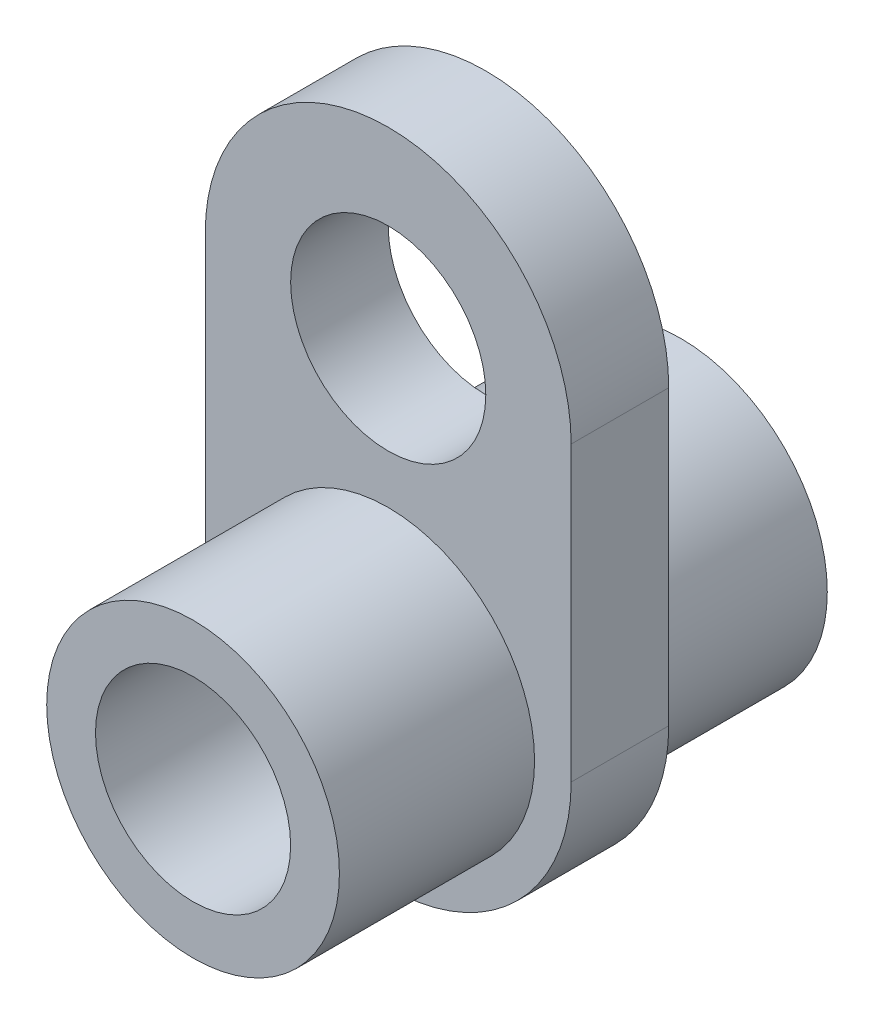
ISO-10303-21;
HEADER;
FILE_DESCRIPTION(('STEP AP214'),'2;1');
FILE_NAME('part.step','',(''),(''),'','','');
FILE_SCHEMA(('AUTOMOTIVE_DESIGN { 1 0 10303 214 1 1 1 1 }'));
ENDSEC;
DATA;
#1=APPLICATION_CONTEXT('core data for automotive mechanical design processes');
#2=APPLICATION_PROTOCOL_DEFINITION('international standard','automotive_design',2000,#1);
#3=PRODUCT_CONTEXT('',#1,'mechanical');
#4=PRODUCT('Part','Part','',(#3));
#5=PRODUCT_RELATED_PRODUCT_CATEGORY('part','',(#4));
#6=PRODUCT_DEFINITION_FORMATION('','',#4);
#7=PRODUCT_DEFINITION_CONTEXT('part definition',#1,'design');
#8=PRODUCT_DEFINITION('design','',#6,#7);
#9=PRODUCT_DEFINITION_SHAPE('','',#8);
#10=(LENGTH_UNIT() NAMED_UNIT(*) SI_UNIT(.MILLI.,.METRE.));
#11=(NAMED_UNIT(*) PLANE_ANGLE_UNIT() SI_UNIT($,.RADIAN.));
#12=(NAMED_UNIT(*) SI_UNIT($,.STERADIAN.) SOLID_ANGLE_UNIT());
#13=UNCERTAINTY_MEASURE_WITH_UNIT(LENGTH_MEASURE(1.E-05),#10,'distance_accuracy_value','');
#14=(GEOMETRIC_REPRESENTATION_CONTEXT(3) GLOBAL_UNCERTAINTY_ASSIGNED_CONTEXT((#13)) GLOBAL_UNIT_ASSIGNED_CONTEXT((#10,
#11,#12)) REPRESENTATION_CONTEXT('',''));
#15=CARTESIAN_POINT('',(0.,0.,0.));
#16=DIRECTION('',(0.,0.,1.));
#17=DIRECTION('',(1.,0.,0.));
#18=AXIS2_PLACEMENT_3D('',#15,#16,#17);
#19=CARTESIAN_POINT('',(-7.50000000000001,0.,-2.));
#20=DIRECTION('',(-1.,0.,0.));
#21=DIRECTION('',(0.,0.,1.));
#22=AXIS2_PLACEMENT_3D('',#19,#20,#21);
#23=PLANE('',#22);
#24=DIRECTION('',(0.,0.,1.));
#25=VECTOR('',#24,1.);
#26=CARTESIAN_POINT('',(-7.50000000000001,-6.,-2.));
#27=LINE('',#26,#25);
#28=CARTESIAN_POINT('',(-7.50000000000001,-6.,-2.));
#29=VERTEX_POINT('',#28);
#30=CARTESIAN_POINT('',(-7.50000000000001,-6.,2.));
#31=VERTEX_POINT('',#30);
#32=EDGE_CURVE('E73',#29,#31,#27,.T.);
#33=ORIENTED_EDGE('',*,*,#32,.T.);
#34=DIRECTION('',(0.,-1.,0.));
#35=VECTOR('',#34,1.);
#36=CARTESIAN_POINT('',(-7.50000000000001,0.,2.));
#37=LINE('',#36,#35);
#38=CARTESIAN_POINT('',(-7.50000000000001,6.,2.));
#39=VERTEX_POINT('',#38);
#40=EDGE_CURVE('E76',#39,#31,#37,.T.);
#41=ORIENTED_EDGE('',*,*,#40,.F.);
#42=DIRECTION('',(0.,0.,1.));
#43=VECTOR('',#42,1.);
#44=CARTESIAN_POINT('',(-7.50000000000001,6.,-2.));
#45=LINE('',#44,#43);
#46=CARTESIAN_POINT('',(-7.50000000000001,6.,-2.));
#47=VERTEX_POINT('',#46);
#48=EDGE_CURVE('E42',#47,#39,#45,.T.);
#49=ORIENTED_EDGE('',*,*,#48,.F.);
#50=DIRECTION('',(0.,-1.,0.));
#51=VECTOR('',#50,1.);
#52=CARTESIAN_POINT('',(-7.50000000000001,0.,-2.));
#53=LINE('',#52,#51);
#54=EDGE_CURVE('E77',#47,#29,#53,.T.);
#55=ORIENTED_EDGE('',*,*,#54,.T.);
#56=EDGE_LOOP('',(#33,#41,#49,#55));
#57=FACE_BOUND('',#56,.T.);
#58=ADVANCED_FACE('F34',(#57),#23,.T.);
#59=CARTESIAN_POINT('',(0.,6.00000000000001,-2.));
#60=DIRECTION('',(0.,0.,1.));
#61=DIRECTION('',(1.,0.,0.));
#62=AXIS2_PLACEMENT_3D('',#59,#60,#61);
#63=CYLINDRICAL_SURFACE('',#62,7.50000000000001);
#64=ORIENTED_EDGE('',*,*,#48,.T.);
#65=CARTESIAN_POINT('',(0.,6.00000000000001,2.));
#66=DIRECTION('',(0.,0.,1.));
#67=DIRECTION('',(1.,0.,0.));
#68=AXIS2_PLACEMENT_3D('',#65,#66,#67);
#69=CIRCLE('',#68,7.50000000000001);
#70=CARTESIAN_POINT('',(7.50000000000002,6.,2.));
#71=VERTEX_POINT('',#70);
#72=EDGE_CURVE('E94',#71,#39,#69,.T.);
#73=ORIENTED_EDGE('',*,*,#72,.F.);
#74=DIRECTION('',(0.,0.,1.));
#75=VECTOR('',#74,1.);
#76=CARTESIAN_POINT('',(7.50000000000002,6.,-2.));
#77=LINE('',#76,#75);
#78=CARTESIAN_POINT('',(7.50000000000002,6.,-2.));
#79=VERTEX_POINT('',#78);
#80=EDGE_CURVE('E56',#79,#71,#77,.T.);
#81=ORIENTED_EDGE('',*,*,#80,.F.);
#82=CARTESIAN_POINT('',(0.,6.00000000000001,-2.));
#83=DIRECTION('',(0.,0.,1.));
#84=DIRECTION('',(1.,0.,0.));
#85=AXIS2_PLACEMENT_3D('',#82,#83,#84);
#86=CIRCLE('',#85,7.50000000000001);
#87=EDGE_CURVE('E82',#79,#47,#86,.T.);
#88=ORIENTED_EDGE('',*,*,#87,.T.);
#89=EDGE_LOOP('',(#64,#73,#81,#88));
#90=FACE_BOUND('',#89,.T.);
#91=ADVANCED_FACE('F118',(#90),#63,.T.);
#92=CARTESIAN_POINT('',(7.50000000000002,0.,-2.));
#93=DIRECTION('',(-1.,0.,0.));
#94=DIRECTION('',(0.,0.,1.));
#95=AXIS2_PLACEMENT_3D('',#92,#93,#94);
#96=PLANE('',#95);
#97=ORIENTED_EDGE('',*,*,#80,.T.);
#98=DIRECTION('',(0.,-1.,0.));
#99=VECTOR('',#98,1.);
#100=CARTESIAN_POINT('',(7.50000000000002,0.,2.));
#101=LINE('',#100,#99);
#102=CARTESIAN_POINT('',(7.50000000000002,-6.,2.));
#103=VERTEX_POINT('',#102);
#104=EDGE_CURVE('E90',#71,#103,#101,.T.);
#105=ORIENTED_EDGE('',*,*,#104,.T.);
#106=DIRECTION('',(0.,0.,1.));
#107=VECTOR('',#106,1.);
#108=CARTESIAN_POINT('',(7.50000000000002,-6.,-2.));
#109=LINE('',#108,#107);
#110=CARTESIAN_POINT('',(7.50000000000002,-6.,-2.));
#111=VERTEX_POINT('',#110);
#112=EDGE_CURVE('E81',#111,#103,#109,.T.);
#113=ORIENTED_EDGE('',*,*,#112,.F.);
#114=DIRECTION('',(0.,-1.,0.));
#115=VECTOR('',#114,1.);
#116=CARTESIAN_POINT('',(7.50000000000002,0.,-2.));
#117=LINE('',#116,#115);
#118=EDGE_CURVE('E110',#79,#111,#117,.T.);
#119=ORIENTED_EDGE('',*,*,#118,.F.);
#120=EDGE_LOOP('',(#97,#105,#113,#119));
#121=FACE_BOUND('',#120,.T.);
#122=ADVANCED_FACE('F116',(#121),#96,.F.);
#123=CARTESIAN_POINT('',(0.,-6.,-2.));
#124=DIRECTION('',(0.,0.,1.));
#125=DIRECTION('',(1.,0.,0.));
#126=AXIS2_PLACEMENT_3D('',#123,#124,#125);
#127=CYLINDRICAL_SURFACE('',#126,7.50000000000001);
#128=ORIENTED_EDGE('',*,*,#112,.T.);
#129=CARTESIAN_POINT('',(0.,-6.,2.));
#130=DIRECTION('',(0.,0.,1.));
#131=DIRECTION('',(1.,0.,0.));
#132=AXIS2_PLACEMENT_3D('',#129,#130,#131);
#133=CIRCLE('',#132,7.50000000000001);
#134=EDGE_CURVE('E84',#31,#103,#133,.T.);
#135=ORIENTED_EDGE('',*,*,#134,.F.);
#136=ORIENTED_EDGE('',*,*,#32,.F.);
#137=CARTESIAN_POINT('',(0.,-6.,-2.));
#138=DIRECTION('',(0.,0.,1.));
#139=DIRECTION('',(1.,0.,0.));
#140=AXIS2_PLACEMENT_3D('',#137,#138,#139);
#141=CIRCLE('',#140,7.50000000000001);
#142=EDGE_CURVE('E108',#29,#111,#141,.T.);
#143=ORIENTED_EDGE('',*,*,#142,.T.);
#144=EDGE_LOOP('',(#128,#135,#136,#143));
#145=FACE_BOUND('',#144,.T.);
#146=ADVANCED_FACE('F85',(#145),#127,.T.);
#147=CARTESIAN_POINT('',(0.,6.00000000000001,-2.));
#148=DIRECTION('',(0.,0.,1.));
#149=DIRECTION('',(1.,0.,0.));
#150=AXIS2_PLACEMENT_3D('',#147,#148,#149);
#151=CYLINDRICAL_SURFACE('',#150,4.00000000000001);
#152=CARTESIAN_POINT('',(0.,6.00000000000001,-2.));
#153=DIRECTION('',(0.,0.,1.));
#154=DIRECTION('',(1.,0.,0.));
#155=AXIS2_PLACEMENT_3D('',#152,#153,#154);
#156=CIRCLE('',#155,4.00000000000001);
#157=CARTESIAN_POINT('',(4.00000000000002,6.00000000000001,-2.));
#158=VERTEX_POINT('',#157);
#159=EDGE_CURVE('E104',#158,#158,#156,.T.);
#160=ORIENTED_EDGE('',*,*,#159,.F.);
#161=EDGE_LOOP('',(#160));
#162=FACE_BOUND('',#161,.T.);
#163=CARTESIAN_POINT('',(0.,6.00000000000001,2.));
#164=DIRECTION('',(0.,0.,1.));
#165=DIRECTION('',(1.,0.,0.));
#166=AXIS2_PLACEMENT_3D('',#163,#164,#165);
#167=CIRCLE('',#166,4.00000000000001);
#168=CARTESIAN_POINT('',(4.00000000000002,6.00000000000001,2.));
#169=VERTEX_POINT('',#168);
#170=EDGE_CURVE('E95',#169,#169,#167,.T.);
#171=ORIENTED_EDGE('',*,*,#170,.T.);
#172=EDGE_LOOP('',(#171));
#173=FACE_BOUND('',#172,.T.);
#174=ADVANCED_FACE('F36',(#162,#173),#151,.F.);
#175=CARTESIAN_POINT('',(0.,0.,-2.));
#176=DIRECTION('',(0.,0.,1.));
#177=DIRECTION('',(1.,0.,0.));
#178=AXIS2_PLACEMENT_3D('',#175,#176,#177);
#179=PLANE('',#178);
#180=CARTESIAN_POINT('',(0.,-6.,-2.));
#181=DIRECTION('',(0.,0.,1.));
#182=DIRECTION('',(1.,0.,0.));
#183=AXIS2_PLACEMENT_3D('',#180,#181,#182);
#184=CIRCLE('',#183,6.00000000000001);
#185=CARTESIAN_POINT('',(5.99999999999998,-6.,-2.));
#186=VERTEX_POINT('',#185);
#187=EDGE_CURVE('E98',#186,#186,#184,.T.);
#188=ORIENTED_EDGE('',*,*,#187,.T.);
#189=EDGE_LOOP('',(#188));
#190=FACE_BOUND('',#189,.T.);
#191=ORIENTED_EDGE('',*,*,#159,.T.);
#192=EDGE_LOOP('',(#191));
#193=FACE_BOUND('',#192,.T.);
#194=ORIENTED_EDGE('',*,*,#54,.F.);
#195=ORIENTED_EDGE('',*,*,#87,.F.);
#196=ORIENTED_EDGE('',*,*,#118,.T.);
#197=ORIENTED_EDGE('',*,*,#142,.F.);
#198=EDGE_LOOP('',(#194,#195,#196,#197));
#199=FACE_BOUND('',#198,.T.);
#200=ADVANCED_FACE('F120',(#190,#193,#199),#179,.F.);
#201=CARTESIAN_POINT('',(0.,0.,2.));
#202=DIRECTION('',(0.,0.,1.));
#203=DIRECTION('',(1.,0.,0.));
#204=AXIS2_PLACEMENT_3D('',#201,#202,#203);
#205=PLANE('',#204);
#206=CARTESIAN_POINT('',(0.,-6.,2.));
#207=DIRECTION('',(0.,0.,1.));
#208=DIRECTION('',(1.,0.,0.));
#209=AXIS2_PLACEMENT_3D('',#206,#207,#208);
#210=CIRCLE('',#209,6.00000000000001);
#211=CARTESIAN_POINT('',(5.99999999999998,-6.,2.));
#212=VERTEX_POINT('',#211);
#213=EDGE_CURVE('E11',#212,#212,#210,.T.);
#214=ORIENTED_EDGE('',*,*,#213,.F.);
#215=EDGE_LOOP('',(#214));
#216=FACE_BOUND('',#215,.T.);
#217=ORIENTED_EDGE('',*,*,#170,.F.);
#218=EDGE_LOOP('',(#217));
#219=FACE_BOUND('',#218,.T.);
#220=ORIENTED_EDGE('',*,*,#40,.T.);
#221=ORIENTED_EDGE('',*,*,#134,.T.);
#222=ORIENTED_EDGE('',*,*,#104,.F.);
#223=ORIENTED_EDGE('',*,*,#72,.T.);
#224=EDGE_LOOP('',(#220,#221,#222,#223));
#225=FACE_BOUND('',#224,.T.);
#226=ADVANCED_FACE('F93',(#216,#219,#225),#205,.T.);
#227=CARTESIAN_POINT('',(0.,0.,10.));
#228=DIRECTION('',(0.,0.,1.));
#229=DIRECTION('',(1.,0.,0.));
#230=AXIS2_PLACEMENT_3D('',#227,#228,#229);
#231=PLANE('',#230);
#232=CARTESIAN_POINT('',(0.,-6.,10.));
#233=DIRECTION('',(0.,0.,1.));
#234=DIRECTION('',(1.,0.,0.));
#235=AXIS2_PLACEMENT_3D('',#232,#233,#234);
#236=CIRCLE('',#235,4.00000000000001);
#237=CARTESIAN_POINT('',(3.99999999999998,-6.,10.));
#238=VERTEX_POINT('',#237);
#239=EDGE_CURVE('E160',#238,#238,#236,.T.);
#240=ORIENTED_EDGE('',*,*,#239,.F.);
#241=EDGE_LOOP('',(#240));
#242=FACE_BOUND('',#241,.T.);
#243=CARTESIAN_POINT('',(0.,-6.,10.));
#244=DIRECTION('',(0.,0.,1.));
#245=DIRECTION('',(1.,0.,0.));
#246=AXIS2_PLACEMENT_3D('',#243,#244,#245);
#247=CIRCLE('',#246,6.00000000000001);
#248=CARTESIAN_POINT('',(5.99999999999998,-6.,10.));
#249=VERTEX_POINT('',#248);
#250=EDGE_CURVE('E166',#249,#249,#247,.T.);
#251=ORIENTED_EDGE('',*,*,#250,.T.);
#252=EDGE_LOOP('',(#251));
#253=FACE_BOUND('',#252,.T.);
#254=ADVANCED_FACE('F128',(#242,#253),#231,.T.);
#255=CARTESIAN_POINT('',(0.,-6.,-10.));
#256=DIRECTION('',(0.,0.,1.));
#257=DIRECTION('',(1.,0.,0.));
#258=AXIS2_PLACEMENT_3D('',#255,#256,#257);
#259=CYLINDRICAL_SURFACE('',#258,6.00000000000001);
#260=ORIENTED_EDGE('',*,*,#213,.T.);
#261=EDGE_LOOP('',(#260));
#262=FACE_BOUND('',#261,.T.);
#263=ORIENTED_EDGE('',*,*,#250,.F.);
#264=EDGE_LOOP('',(#263));
#265=FACE_BOUND('',#264,.T.);
#266=ADVANCED_FACE('F147',(#262,#265),#259,.T.);
#267=CARTESIAN_POINT('',(0.,-6.,-2.));
#268=DIRECTION('',(0.,0.,1.));
#269=DIRECTION('',(1.,0.,0.));
#270=AXIS2_PLACEMENT_3D('',#267,#268,#269);
#271=CYLINDRICAL_SURFACE('',#270,4.00000000000001);
#272=ORIENTED_EDGE('',*,*,#239,.T.);
#273=EDGE_LOOP('',(#272));
#274=FACE_BOUND('',#273,.T.);
#275=CARTESIAN_POINT('',(0.,-6.,-10.));
#276=DIRECTION('',(0.,0.,1.));
#277=DIRECTION('',(1.,0.,0.));
#278=AXIS2_PLACEMENT_3D('',#275,#276,#277);
#279=CIRCLE('',#278,4.00000000000001);
#280=CARTESIAN_POINT('',(3.99999999999998,-6.,-10.));
#281=VERTEX_POINT('',#280);
#282=EDGE_CURVE('E163',#281,#281,#279,.T.);
#283=ORIENTED_EDGE('',*,*,#282,.F.);
#284=EDGE_LOOP('',(#283));
#285=FACE_BOUND('',#284,.T.);
#286=ADVANCED_FACE('F144',(#274,#285),#271,.F.);
#287=CARTESIAN_POINT('',(0.,-6.,-10.));
#288=DIRECTION('',(0.,0.,1.));
#289=DIRECTION('',(1.,0.,0.));
#290=AXIS2_PLACEMENT_3D('',#287,#288,#289);
#291=CIRCLE('',#290,6.00000000000001);
#292=CARTESIAN_POINT('',(5.99999999999998,-6.,-10.));
#293=VERTEX_POINT('',#292);
#294=EDGE_CURVE('E165',#293,#293,#291,.T.);
#295=ORIENTED_EDGE('',*,*,#294,.T.);
#296=EDGE_LOOP('',(#295));
#297=FACE_BOUND('',#296,.T.);
#298=ORIENTED_EDGE('',*,*,#187,.F.);
#299=EDGE_LOOP('',(#298));
#300=FACE_BOUND('',#299,.T.);
#301=ADVANCED_FACE('F146',(#297,#300),#259,.T.);
#302=CARTESIAN_POINT('',(0.,0.,-10.));
#303=DIRECTION('',(0.,0.,1.));
#304=DIRECTION('',(1.,0.,0.));
#305=AXIS2_PLACEMENT_3D('',#302,#303,#304);
#306=PLANE('',#305);
#307=ORIENTED_EDGE('',*,*,#282,.T.);
#308=EDGE_LOOP('',(#307));
#309=FACE_BOUND('',#308,.T.);
#310=ORIENTED_EDGE('',*,*,#294,.F.);
#311=EDGE_LOOP('',(#310));
#312=FACE_BOUND('',#311,.T.);
#313=ADVANCED_FACE('F153',(#309,#312),#306,.F.);
#314=CLOSED_SHELL('',(#58,#91,#122,#146,#174,#200,#226,#254,#266,#286,#301,#313));
#315=MANIFOLD_SOLID_BREP('B2',#314);
#316=ADVANCED_BREP_SHAPE_REPRESENTATION('',(#18,#315),#14);
#317=SHAPE_DEFINITION_REPRESENTATION(#9,#316);
ENDSEC;
END-ISO-10303-21;
